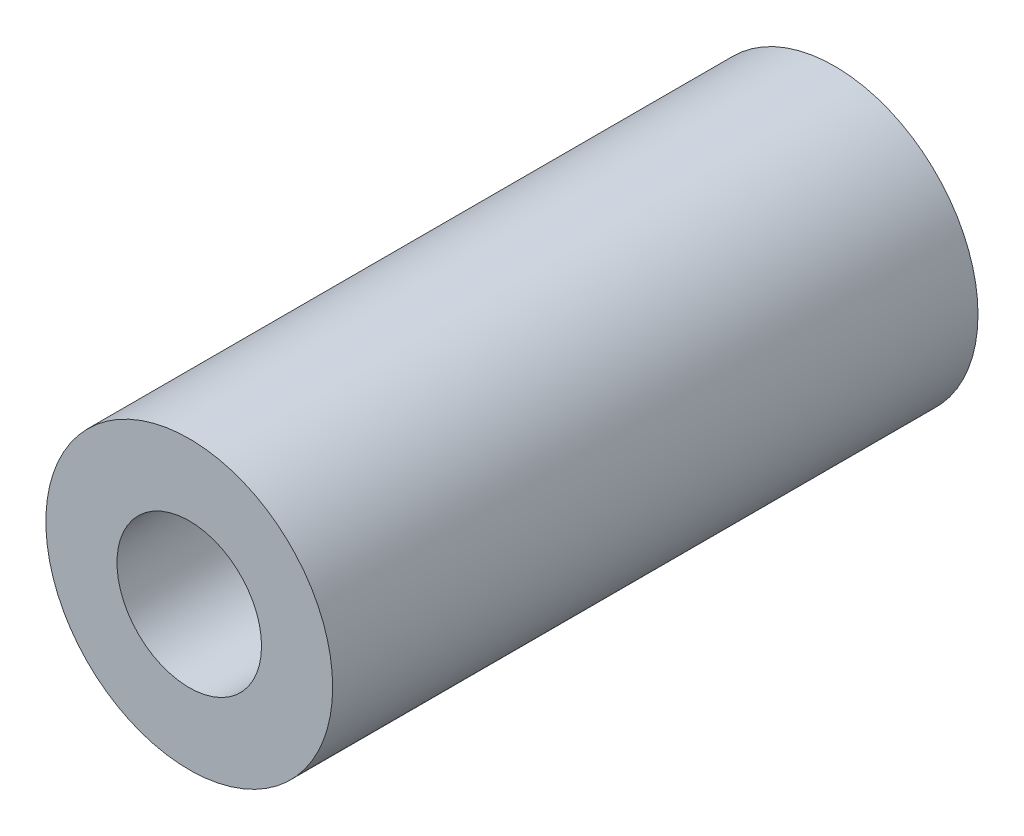
ISO-10303-21;
HEADER;
FILE_DESCRIPTION(('STEP AP214'),'2;1');
FILE_NAME('part.step','',(''),(''),'','','');
FILE_SCHEMA(('AUTOMOTIVE_DESIGN { 1 0 10303 214 1 1 1 1 }'));
ENDSEC;
DATA;
#1=APPLICATION_CONTEXT('core data for automotive mechanical design processes');
#2=APPLICATION_PROTOCOL_DEFINITION('international standard','automotive_design',2000,#1);
#3=PRODUCT_CONTEXT('',#1,'mechanical');
#4=PRODUCT('Part','Part','',(#3));
#5=PRODUCT_RELATED_PRODUCT_CATEGORY('part','',(#4));
#6=PRODUCT_DEFINITION_FORMATION('','',#4);
#7=PRODUCT_DEFINITION_CONTEXT('part definition',#1,'design');
#8=PRODUCT_DEFINITION('design','',#6,#7);
#9=PRODUCT_DEFINITION_SHAPE('','',#8);
#10=(LENGTH_UNIT() NAMED_UNIT(*) SI_UNIT(.MILLI.,.METRE.));
#11=(NAMED_UNIT(*) PLANE_ANGLE_UNIT() SI_UNIT($,.RADIAN.));
#12=(NAMED_UNIT(*) SI_UNIT($,.STERADIAN.) SOLID_ANGLE_UNIT());
#13=UNCERTAINTY_MEASURE_WITH_UNIT(LENGTH_MEASURE(1.E-05),#10,'distance_accuracy_value','');
#14=(GEOMETRIC_REPRESENTATION_CONTEXT(3) GLOBAL_UNCERTAINTY_ASSIGNED_CONTEXT((#13)) GLOBAL_UNIT_ASSIGNED_CONTEXT((#10,
#11,#12)) REPRESENTATION_CONTEXT('',''));
#15=CARTESIAN_POINT('',(0.,0.,0.));
#16=DIRECTION('',(0.,0.,1.));
#17=DIRECTION('',(1.,0.,0.));
#18=AXIS2_PLACEMENT_3D('',#15,#16,#17);
#19=CARTESIAN_POINT('',(0.,0.,14.2875));
#20=DIRECTION('',(0.,0.,1.));
#21=DIRECTION('',(1.,0.,0.));
#22=AXIS2_PLACEMENT_3D('',#19,#20,#21);
#23=PLANE('',#22);
#24=CARTESIAN_POINT('',(0.,0.,14.2875));
#25=DIRECTION('',(0.,0.,1.));
#26=DIRECTION('',(1.,0.,0.));
#27=AXIS2_PLACEMENT_3D('',#24,#25,#26);
#28=CIRCLE('',#27,6.35);
#29=CARTESIAN_POINT('',(6.35,0.,14.2875));
#30=VERTEX_POINT('',#29);
#31=EDGE_CURVE('E10',#30,#30,#28,.T.);
#32=ORIENTED_EDGE('',*,*,#31,.T.);
#33=EDGE_LOOP('',(#32));
#34=FACE_BOUND('',#33,.T.);
#35=CARTESIAN_POINT('',(0.,0.,14.2875));
#36=DIRECTION('',(0.,0.,1.));
#37=DIRECTION('',(1.,0.,0.));
#38=AXIS2_PLACEMENT_3D('',#35,#36,#37);
#39=CIRCLE('',#38,3.2004);
#40=CARTESIAN_POINT('',(3.2004,0.,14.2875));
#41=VERTEX_POINT('',#40);
#42=EDGE_CURVE('E43',#41,#41,#39,.T.);
#43=ORIENTED_EDGE('',*,*,#42,.F.);
#44=EDGE_LOOP('',(#43));
#45=FACE_BOUND('',#44,.T.);
#46=ADVANCED_FACE('F32',(#34,#45),#23,.T.);
#47=CARTESIAN_POINT('',(0.,0.,-14.2875));
#48=DIRECTION('',(0.,0.,1.));
#49=DIRECTION('',(1.,0.,0.));
#50=AXIS2_PLACEMENT_3D('',#47,#48,#49);
#51=PLANE('',#50);
#52=CARTESIAN_POINT('',(0.,0.,-14.2875));
#53=DIRECTION('',(0.,0.,1.));
#54=DIRECTION('',(1.,0.,0.));
#55=AXIS2_PLACEMENT_3D('',#52,#53,#54);
#56=CIRCLE('',#55,6.35);
#57=CARTESIAN_POINT('',(6.35,0.,-14.2875));
#58=VERTEX_POINT('',#57);
#59=EDGE_CURVE('E36',#58,#58,#56,.T.);
#60=ORIENTED_EDGE('',*,*,#59,.F.);
#61=EDGE_LOOP('',(#60));
#62=FACE_BOUND('',#61,.T.);
#63=CARTESIAN_POINT('',(0.,0.,-14.2875));
#64=DIRECTION('',(0.,0.,1.));
#65=DIRECTION('',(1.,0.,0.));
#66=AXIS2_PLACEMENT_3D('',#63,#64,#65);
#67=CIRCLE('',#66,3.2004);
#68=CARTESIAN_POINT('',(3.2004,0.,-14.2875));
#69=VERTEX_POINT('',#68);
#70=EDGE_CURVE('E45',#69,#69,#67,.T.);
#71=ORIENTED_EDGE('',*,*,#70,.T.);
#72=EDGE_LOOP('',(#71));
#73=FACE_BOUND('',#72,.T.);
#74=ADVANCED_FACE('F55',(#62,#73),#51,.F.);
#75=CARTESIAN_POINT('',(0.,0.,14.2875));
#76=DIRECTION('',(0.,0.,-1.));
#77=DIRECTION('',(-1.,0.,0.));
#78=AXIS2_PLACEMENT_3D('',#75,#76,#77);
#79=CYLINDRICAL_SURFACE('',#78,6.35);
#80=ORIENTED_EDGE('',*,*,#31,.F.);
#81=EDGE_LOOP('',(#80));
#82=FACE_BOUND('',#81,.T.);
#83=ORIENTED_EDGE('',*,*,#59,.T.);
#84=EDGE_LOOP('',(#83));
#85=FACE_BOUND('',#84,.T.);
#86=ADVANCED_FACE('F34',(#82,#85),#79,.T.);
#87=CARTESIAN_POINT('',(0.,0.,14.2875));
#88=DIRECTION('',(0.,0.,-1.));
#89=DIRECTION('',(-1.,0.,0.));
#90=AXIS2_PLACEMENT_3D('',#87,#88,#89);
#91=CYLINDRICAL_SURFACE('',#90,3.2004);
#92=ORIENTED_EDGE('',*,*,#42,.T.);
#93=EDGE_LOOP('',(#92));
#94=FACE_BOUND('',#93,.T.);
#95=ORIENTED_EDGE('',*,*,#70,.F.);
#96=EDGE_LOOP('',(#95));
#97=FACE_BOUND('',#96,.T.);
#98=ADVANCED_FACE('F51',(#94,#97),#91,.F.);
#99=CLOSED_SHELL('',(#46,#74,#86,#98));
#100=MANIFOLD_SOLID_BREP('B2',#99);
#101=ADVANCED_BREP_SHAPE_REPRESENTATION('',(#18,#100),#14);
#102=SHAPE_DEFINITION_REPRESENTATION(#9,#101);
ENDSEC;
END-ISO-10303-21;
